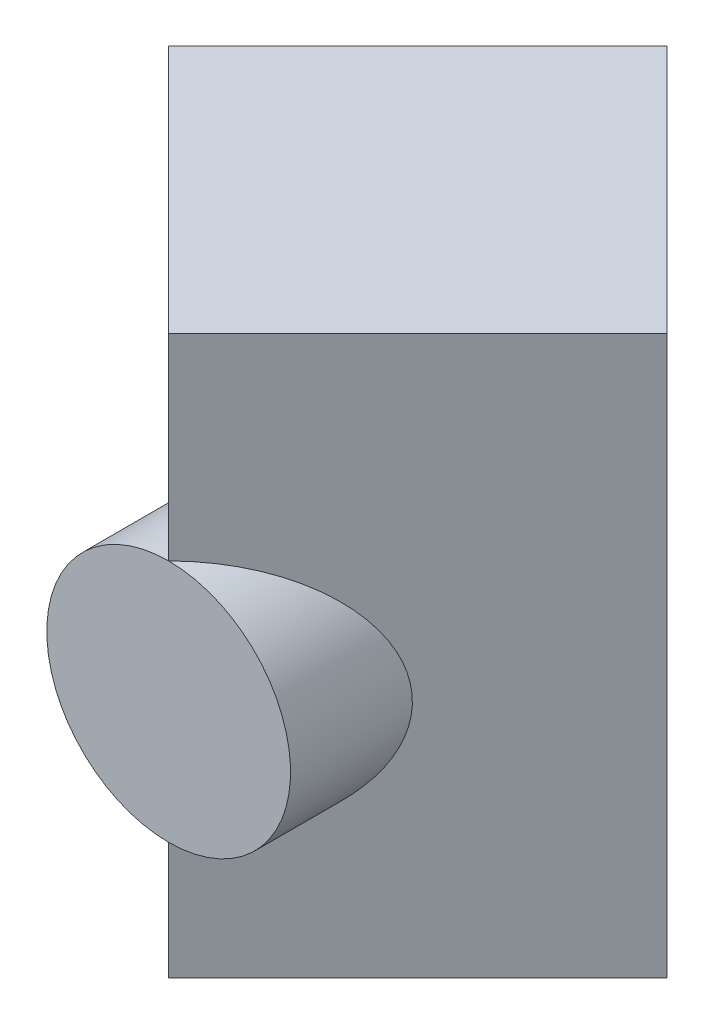
ISO-10303-21;
HEADER;
FILE_DESCRIPTION(('STEP AP214'),'2;1');
FILE_NAME('part.step','',(''),(''),'','','');
FILE_SCHEMA(('AUTOMOTIVE_DESIGN { 1 0 10303 214 1 1 1 1 }'));
ENDSEC;
DATA;
#1=APPLICATION_CONTEXT('core data for automotive mechanical design processes');
#2=APPLICATION_PROTOCOL_DEFINITION('international standard','automotive_design',2000,#1);
#3=PRODUCT_CONTEXT('',#1,'mechanical');
#4=PRODUCT('Part','Part','',(#3));
#5=PRODUCT_RELATED_PRODUCT_CATEGORY('part','',(#4));
#6=PRODUCT_DEFINITION_FORMATION('','',#4);
#7=PRODUCT_DEFINITION_CONTEXT('part definition',#1,'design');
#8=PRODUCT_DEFINITION('design','',#6,#7);
#9=PRODUCT_DEFINITION_SHAPE('','',#8);
#10=(LENGTH_UNIT() NAMED_UNIT(*) SI_UNIT(.MILLI.,.METRE.));
#11=(NAMED_UNIT(*) PLANE_ANGLE_UNIT() SI_UNIT($,.RADIAN.));
#12=(NAMED_UNIT(*) SI_UNIT($,.STERADIAN.) SOLID_ANGLE_UNIT());
#13=UNCERTAINTY_MEASURE_WITH_UNIT(LENGTH_MEASURE(1.E-05),#10,'distance_accuracy_value','');
#14=(GEOMETRIC_REPRESENTATION_CONTEXT(3) GLOBAL_UNCERTAINTY_ASSIGNED_CONTEXT((#13)) GLOBAL_UNIT_ASSIGNED_CONTEXT((#10,
#11,#12)) REPRESENTATION_CONTEXT('',''));
#15=CARTESIAN_POINT('',(0.,0.,0.));
#16=DIRECTION('',(0.,0.,1.));
#17=DIRECTION('',(1.,0.,0.));
#18=AXIS2_PLACEMENT_3D('',#15,#16,#17);
#19=CARTESIAN_POINT('',(0.,95.,-84.8528137423857));
#20=DIRECTION('',(0.707106781186548,0.,0.707106781186547));
#21=DIRECTION('',(0.707106781186547,0.,-0.707106781186548));
#22=AXIS2_PLACEMENT_3D('',#19,#20,#21);
#23=PLANE('',#22);
#24=DIRECTION('',(-0.707106781186547,0.,0.707106781186548));
#25=VECTOR('',#24,1.);
#26=CARTESIAN_POINT('',(0.,-95.,-84.8528137423857));
#27=LINE('',#26,#25);
#28=CARTESIAN_POINT('',(0.,-95.,-84.8528137423857));
#29=VERTEX_POINT('',#28);
#30=CARTESIAN_POINT('',(-84.8528137423857,-95.,0.));
#31=VERTEX_POINT('',#30);
#32=EDGE_CURVE('E111',#29,#31,#27,.T.);
#33=ORIENTED_EDGE('',*,*,#32,.T.);
#34=DIRECTION('',(0.,-1.,0.));
#35=VECTOR('',#34,1.);
#36=CARTESIAN_POINT('',(-84.8528137423857,95.,0.));
#37=LINE('',#36,#35);
#38=CARTESIAN_POINT('',(-84.8528137423857,95.,0.));
#39=VERTEX_POINT('',#38);
#40=EDGE_CURVE('E46',#39,#31,#37,.T.);
#41=ORIENTED_EDGE('',*,*,#40,.F.);
#42=DIRECTION('',(-0.707106781186547,0.,0.707106781186548));
#43=VECTOR('',#42,1.);
#44=CARTESIAN_POINT('',(0.,95.,-84.8528137423857));
#45=LINE('',#44,#43);
#46=CARTESIAN_POINT('',(0.,95.,-84.8528137423857));
#47=VERTEX_POINT('',#46);
#48=EDGE_CURVE('E123',#47,#39,#45,.T.);
#49=ORIENTED_EDGE('',*,*,#48,.F.);
#50=DIRECTION('',(0.,-1.,0.));
#51=VECTOR('',#50,1.);
#52=CARTESIAN_POINT('',(0.,95.,-84.8528137423857));
#53=LINE('',#52,#51);
#54=EDGE_CURVE('E120',#47,#29,#53,.T.);
#55=ORIENTED_EDGE('',*,*,#54,.T.);
#56=EDGE_LOOP('',(#33,#41,#49,#55));
#57=FACE_BOUND('',#56,.T.);
#58=ADVANCED_FACE('F39',(#57),#23,.F.);
#59=CARTESIAN_POINT('',(-84.8528137423857,95.,0.));
#60=DIRECTION('',(0.707106781186548,0.,-0.707106781186547));
#61=DIRECTION('',(-0.707106781186547,0.,-0.707106781186548));
#62=AXIS2_PLACEMENT_3D('',#59,#60,#61);
#63=PLANE('',#62);
#64=DIRECTION('',(0.,-1.,0.));
#65=VECTOR('',#64,1.);
#66=CARTESIAN_POINT('',(0.,95.,84.8528137423857));
#67=LINE('',#66,#65);
#68=CARTESIAN_POINT('',(0.,-55.,84.8528137423857));
#69=VERTEX_POINT('',#68);
#70=CARTESIAN_POINT('',(0.,-95.,84.8528137423857));
#71=VERTEX_POINT('',#70);
#72=EDGE_CURVE('E110',#69,#71,#67,.T.);
#73=ORIENTED_EDGE('',*,*,#72,.F.);
#74=CARTESIAN_POINT('',(0.,-13.5,84.8528137423857));
#75=DIRECTION('',(0.707106781186548,0.,-0.707106781186547));
#76=DIRECTION('',(0.707106781186547,0.,0.707106781186548));
#77=AXIS2_PLACEMENT_3D('',#74,#75,#76);
#78=ELLIPSE('',#77,58.6898628384835,41.5);
#79=CARTESIAN_POINT('',(0.,28.,84.8528137423857));
#80=VERTEX_POINT('',#79);
#81=EDGE_CURVE('E105',#69,#80,#78,.T.);
#82=ORIENTED_EDGE('',*,*,#81,.T.);
#83=CARTESIAN_POINT('',(0.,95.,84.8528137423857));
#84=VERTEX_POINT('',#83);
#85=EDGE_CURVE('E107',#84,#80,#67,.T.);
#86=ORIENTED_EDGE('',*,*,#85,.F.);
#87=DIRECTION('',(0.707106781186547,0.,0.707106781186548));
#88=VECTOR('',#87,1.);
#89=CARTESIAN_POINT('',(-84.8528137423857,95.,0.));
#90=LINE('',#89,#88);
#91=EDGE_CURVE('E90',#39,#84,#90,.T.);
#92=ORIENTED_EDGE('',*,*,#91,.F.);
#93=ORIENTED_EDGE('',*,*,#40,.T.);
#94=DIRECTION('',(0.707106781186547,0.,0.707106781186548));
#95=VECTOR('',#94,1.);
#96=CARTESIAN_POINT('',(-84.8528137423857,-95.,0.));
#97=LINE('',#96,#95);
#98=EDGE_CURVE('E126',#31,#71,#97,.T.);
#99=ORIENTED_EDGE('',*,*,#98,.T.);
#100=EDGE_LOOP('',(#73,#82,#86,#92,#93,#99));
#101=FACE_BOUND('',#100,.T.);
#102=ADVANCED_FACE('F106',(#101),#63,.F.);
#103=CARTESIAN_POINT('',(0.,95.,84.8528137423857));
#104=DIRECTION('',(-0.707106781186548,0.,-0.707106781186547));
#105=DIRECTION('',(-0.707106781186547,0.,0.707106781186548));
#106=AXIS2_PLACEMENT_3D('',#103,#104,#105);
#107=PLANE('',#106);
#108=ORIENTED_EDGE('',*,*,#85,.T.);
#109=CARTESIAN_POINT('',(0.,-13.5,84.8528137423857));
#110=DIRECTION('',(-0.707106781186548,0.,-0.707106781186547));
#111=DIRECTION('',(-0.707106781186547,0.,0.707106781186548));
#112=AXIS2_PLACEMENT_3D('',#109,#110,#111);
#113=ELLIPSE('',#112,58.6898628384835,41.5);
#114=EDGE_CURVE('E11',#80,#69,#113,.T.);
#115=ORIENTED_EDGE('',*,*,#114,.T.);
#116=ORIENTED_EDGE('',*,*,#72,.T.);
#117=DIRECTION('',(0.707106781186547,0.,-0.707106781186548));
#118=VECTOR('',#117,1.);
#119=CARTESIAN_POINT('',(0.,-95.,84.8528137423857));
#120=LINE('',#119,#118);
#121=CARTESIAN_POINT('',(84.8528137423857,-95.,0.));
#122=VERTEX_POINT('',#121);
#123=EDGE_CURVE('E124',#71,#122,#120,.T.);
#124=ORIENTED_EDGE('',*,*,#123,.T.);
#125=DIRECTION('',(0.,-1.,0.));
#126=VECTOR('',#125,1.);
#127=CARTESIAN_POINT('',(84.8528137423857,95.,0.));
#128=LINE('',#127,#126);
#129=CARTESIAN_POINT('',(84.8528137423857,95.,0.));
#130=VERTEX_POINT('',#129);
#131=EDGE_CURVE('E117',#130,#122,#128,.T.);
#132=ORIENTED_EDGE('',*,*,#131,.F.);
#133=DIRECTION('',(0.707106781186547,0.,-0.707106781186548));
#134=VECTOR('',#133,1.);
#135=CARTESIAN_POINT('',(0.,95.,84.8528137423857));
#136=LINE('',#135,#134);
#137=EDGE_CURVE('E115',#84,#130,#136,.T.);
#138=ORIENTED_EDGE('',*,*,#137,.F.);
#139=EDGE_LOOP('',(#108,#115,#116,#124,#132,#138));
#140=FACE_BOUND('',#139,.T.);
#141=ADVANCED_FACE('F113',(#140),#107,.F.);
#142=CARTESIAN_POINT('',(84.8528137423857,95.,0.));
#143=DIRECTION('',(-0.707106781186547,0.,0.707106781186548));
#144=DIRECTION('',(0.707106781186548,0.,0.707106781186547));
#145=AXIS2_PLACEMENT_3D('',#142,#143,#144);
#146=PLANE('',#145);
#147=DIRECTION('',(-0.707106781186548,0.,-0.707106781186547));
#148=VECTOR('',#147,1.);
#149=CARTESIAN_POINT('',(84.8528137423857,-95.,0.));
#150=LINE('',#149,#148);
#151=EDGE_CURVE('E82',#122,#29,#150,.T.);
#152=ORIENTED_EDGE('',*,*,#151,.T.);
#153=ORIENTED_EDGE('',*,*,#54,.F.);
#154=DIRECTION('',(-0.707106781186548,0.,-0.707106781186547));
#155=VECTOR('',#154,1.);
#156=CARTESIAN_POINT('',(84.8528137423857,95.,0.));
#157=LINE('',#156,#155);
#158=EDGE_CURVE('E61',#130,#47,#157,.T.);
#159=ORIENTED_EDGE('',*,*,#158,.F.);
#160=ORIENTED_EDGE('',*,*,#131,.T.);
#161=EDGE_LOOP('',(#152,#153,#159,#160));
#162=FACE_BOUND('',#161,.T.);
#163=ADVANCED_FACE('F141',(#162),#146,.F.);
#164=CARTESIAN_POINT('',(0.,95.,0.));
#165=DIRECTION('',(0.,1.,0.));
#166=DIRECTION('',(0.,0.,1.));
#167=AXIS2_PLACEMENT_3D('',#164,#165,#166);
#168=PLANE('',#167);
#169=ORIENTED_EDGE('',*,*,#48,.T.);
#170=ORIENTED_EDGE('',*,*,#91,.T.);
#171=ORIENTED_EDGE('',*,*,#137,.T.);
#172=ORIENTED_EDGE('',*,*,#158,.T.);
#173=EDGE_LOOP('',(#169,#170,#171,#172));
#174=FACE_BOUND('',#173,.T.);
#175=ADVANCED_FACE('F135',(#174),#168,.T.);
#176=CARTESIAN_POINT('',(0.,-95.,0.));
#177=DIRECTION('',(0.,1.,0.));
#178=DIRECTION('',(0.,0.,1.));
#179=AXIS2_PLACEMENT_3D('',#176,#177,#178);
#180=PLANE('',#179);
#181=ORIENTED_EDGE('',*,*,#32,.F.);
#182=ORIENTED_EDGE('',*,*,#151,.F.);
#183=ORIENTED_EDGE('',*,*,#123,.F.);
#184=ORIENTED_EDGE('',*,*,#98,.F.);
#185=EDGE_LOOP('',(#181,#182,#183,#184));
#186=FACE_BOUND('',#185,.T.);
#187=ADVANCED_FACE('F140',(#186),#180,.F.);
#188=CARTESIAN_POINT('',(0.,-13.5,39.8528137423857));
#189=DIRECTION('',(0.,0.,1.));
#190=DIRECTION('',(1.,0.,0.));
#191=AXIS2_PLACEMENT_3D('',#188,#189,#190);
#192=CYLINDRICAL_SURFACE('',#191,41.5);
#193=ORIENTED_EDGE('',*,*,#81,.F.);
#194=CARTESIAN_POINT('',(0.,-13.5,84.8528137423857));
#195=DIRECTION('',(0.,0.,1.));
#196=DIRECTION('',(1.,0.,0.));
#197=AXIS2_PLACEMENT_3D('',#194,#195,#196);
#198=CIRCLE('',#197,41.5);
#199=EDGE_CURVE('E52',#80,#69,#198,.T.);
#200=ORIENTED_EDGE('',*,*,#199,.F.);
#201=EDGE_LOOP('',(#193,#200));
#202=FACE_BOUND('',#201,.T.);
#203=ADVANCED_FACE('F104',(#202),#192,.T.);
#204=ORIENTED_EDGE('',*,*,#114,.F.);
#205=EDGE_CURVE('E95',#69,#80,#198,.T.);
#206=ORIENTED_EDGE('',*,*,#205,.F.);
#207=EDGE_LOOP('',(#204,#206));
#208=FACE_BOUND('',#207,.T.);
#209=ADVANCED_FACE('F94',(#208),#192,.T.);
#210=CARTESIAN_POINT('',(0.,-13.5,84.8528137423857));
#211=DIRECTION('',(0.,0.,1.));
#212=DIRECTION('',(1.,0.,0.));
#213=AXIS2_PLACEMENT_3D('',#210,#211,#212);
#214=PLANE('',#213);
#215=ORIENTED_EDGE('',*,*,#205,.T.);
#216=ORIENTED_EDGE('',*,*,#199,.T.);
#217=EDGE_LOOP('',(#215,#216));
#218=FACE_BOUND('',#217,.T.);
#219=ADVANCED_FACE('F100',(#218),#214,.T.);
#220=CLOSED_SHELL('',(#58,#102,#141,#163,#175,#187,#203,#209,#219));
#221=MANIFOLD_SOLID_BREP('B2',#220);
#222=ADVANCED_BREP_SHAPE_REPRESENTATION('',(#18,#221),#14);
#223=SHAPE_DEFINITION_REPRESENTATION(#9,#222);
ENDSEC;
END-ISO-10303-21;
